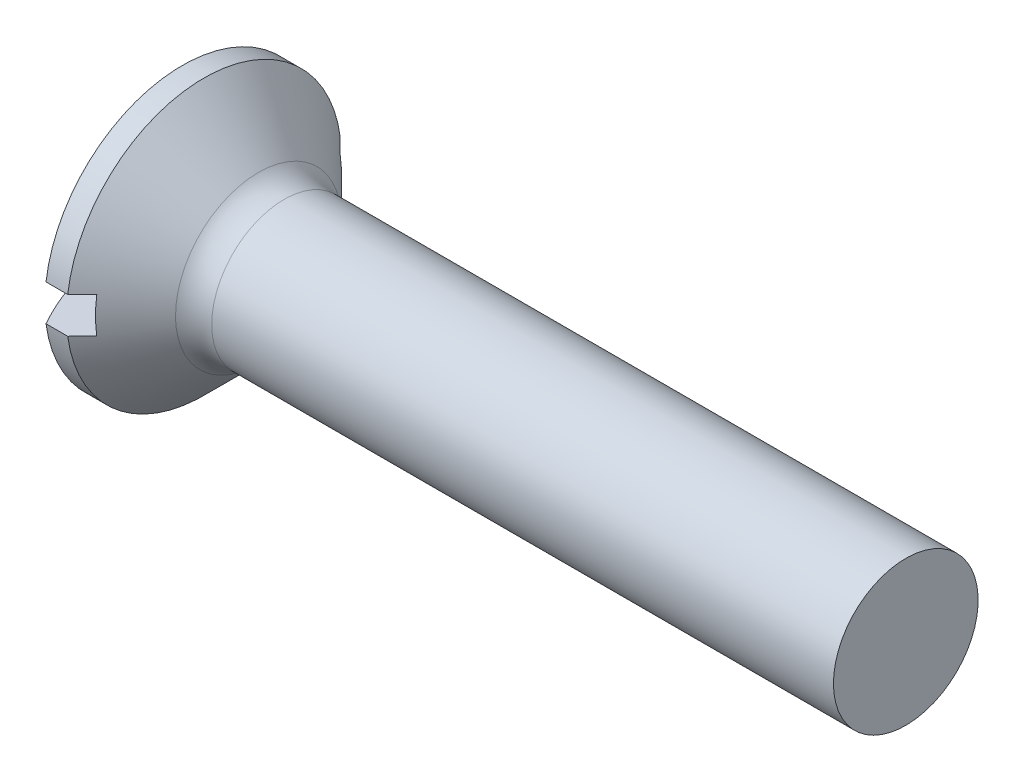
ISO-10303-21;
HEADER;
FILE_DESCRIPTION(('STEP AP214'),'2;1');
FILE_NAME('part.step','',(''),(''),'','','');
FILE_SCHEMA(('AUTOMOTIVE_DESIGN { 1 0 10303 214 1 1 1 1 }'));
ENDSEC;
DATA;
#1=APPLICATION_CONTEXT('core data for automotive mechanical design processes');
#2=APPLICATION_PROTOCOL_DEFINITION('international standard','automotive_design',2000,#1);
#3=PRODUCT_CONTEXT('',#1,'mechanical');
#4=PRODUCT('Part','Part','',(#3));
#5=PRODUCT_RELATED_PRODUCT_CATEGORY('part','',(#4));
#6=PRODUCT_DEFINITION_FORMATION('','',#4);
#7=PRODUCT_DEFINITION_CONTEXT('part definition',#1,'design');
#8=PRODUCT_DEFINITION('design','',#6,#7);
#9=PRODUCT_DEFINITION_SHAPE('','',#8);
#10=(LENGTH_UNIT() NAMED_UNIT(*) SI_UNIT(.MILLI.,.METRE.));
#11=(NAMED_UNIT(*) PLANE_ANGLE_UNIT() SI_UNIT($,.RADIAN.));
#12=(NAMED_UNIT(*) SI_UNIT($,.STERADIAN.) SOLID_ANGLE_UNIT());
#13=UNCERTAINTY_MEASURE_WITH_UNIT(LENGTH_MEASURE(1.E-05),#10,'distance_accuracy_value','');
#14=(GEOMETRIC_REPRESENTATION_CONTEXT(3) GLOBAL_UNCERTAINTY_ASSIGNED_CONTEXT((#13)) GLOBAL_UNIT_ASSIGNED_CONTEXT((#10,
#11,#12)) REPRESENTATION_CONTEXT('',''));
#15=CARTESIAN_POINT('',(0.,0.,0.));
#16=DIRECTION('',(0.,0.,1.));
#17=DIRECTION('',(1.,0.,0.));
#18=AXIS2_PLACEMENT_3D('',#15,#16,#17);
#19=CARTESIAN_POINT('',(3.86,0.,0.));
#20=DIRECTION('',(-1.,0.,0.));
#21=DIRECTION('',(0.,-1.,0.));
#22=AXIS2_PLACEMENT_3D('',#19,#20,#21);
#23=SPHERICAL_SURFACE('',#22,3.86);
#24=CARTESIAN_POINT('',(3.86,0.25,0.));
#25=DIRECTION('',(0.,1.,0.));
#26=DIRECTION('',(0.,0.,1.));
#27=AXIS2_PLACEMENT_3D('',#24,#25,#26);
#28=CIRCLE('',#27,3.85189563721553);
#29=CARTESIAN_POINT('',(0.5,0.25,1.88348082018374));
#30=VERTEX_POINT('',#29);
#31=CARTESIAN_POINT('',(0.5,0.25,-1.88348082018374));
#32=VERTEX_POINT('',#31);
#33=EDGE_CURVE('E184',#30,#32,#28,.F.);
#34=ORIENTED_EDGE('',*,*,#33,.F.);
#35=CARTESIAN_POINT('',(0.5,0.,0.));
#36=DIRECTION('',(-1.,0.,0.));
#37=DIRECTION('',(0.,0.,1.));
#38=AXIS2_PLACEMENT_3D('',#35,#36,#37);
#39=CIRCLE('',#38,1.9);
#40=EDGE_CURVE('E118',#30,#32,#39,.T.);
#41=ORIENTED_EDGE('',*,*,#40,.T.);
#42=EDGE_LOOP('',(#34,#41));
#43=FACE_BOUND('',#42,.T.);
#44=ADVANCED_FACE('F38',(#43),#23,.T.);
#45=CARTESIAN_POINT('',(-15.875,0.,0.));
#46=DIRECTION('',(-1.,0.,0.));
#47=DIRECTION('',(0.,0.,1.));
#48=AXIS2_PLACEMENT_3D('',#45,#46,#47);
#49=CYLINDRICAL_SURFACE('',#48,1.9);
#50=CARTESIAN_POINT('',(0.800000000000002,0.,0.));
#51=DIRECTION('',(-1.,0.,0.));
#52=DIRECTION('',(0.,0.,1.));
#53=AXIS2_PLACEMENT_3D('',#50,#51,#52);
#54=CIRCLE('',#53,1.9);
#55=CARTESIAN_POINT('',(0.800000000000002,0.25,1.88348082018374));
#56=VERTEX_POINT('',#55);
#57=CARTESIAN_POINT('',(0.799999999999999,0.25,-1.88348082018374));
#58=VERTEX_POINT('',#57);
#59=EDGE_CURVE('E112',#56,#58,#54,.T.);
#60=ORIENTED_EDGE('',*,*,#59,.T.);
#61=DIRECTION('',(-1.,0.,0.));
#62=VECTOR('',#61,1.);
#63=CARTESIAN_POINT('',(-15.875,0.25,-1.88348082018374));
#64=LINE('',#63,#62);
#65=EDGE_CURVE('E66',#58,#32,#64,.T.);
#66=ORIENTED_EDGE('',*,*,#65,.T.);
#67=ORIENTED_EDGE('',*,*,#40,.F.);
#68=DIRECTION('',(-1.,0.,0.));
#69=VECTOR('',#68,1.);
#70=CARTESIAN_POINT('',(-15.875,0.25,1.88348082018374));
#71=LINE('',#70,#69);
#72=EDGE_CURVE('E182',#30,#56,#71,.F.);
#73=ORIENTED_EDGE('',*,*,#72,.T.);
#74=EDGE_LOOP('',(#60,#66,#67,#73));
#75=FACE_BOUND('',#74,.T.);
#76=ADVANCED_FACE('F156',(#75),#49,.T.);
#77=CARTESIAN_POINT('',(10.5,0.,0.));
#78=DIRECTION('',(-1.,0.,0.));
#79=DIRECTION('',(0.,0.,1.));
#80=AXIS2_PLACEMENT_3D('',#77,#78,#79);
#81=PLANE('',#80);
#82=CARTESIAN_POINT('',(10.5,0.,0.));
#83=DIRECTION('',(-1.,0.,0.));
#84=DIRECTION('',(0.,0.,1.));
#85=AXIS2_PLACEMENT_3D('',#82,#83,#84);
#86=CIRCLE('',#85,1.);
#87=CARTESIAN_POINT('',(10.5,0.,1.));
#88=VERTEX_POINT('',#87);
#89=EDGE_CURVE('E121',#88,#88,#86,.T.);
#90=ORIENTED_EDGE('',*,*,#89,.F.);
#91=EDGE_LOOP('',(#90));
#92=FACE_BOUND('',#91,.T.);
#93=ADVANCED_FACE('F163',(#92),#81,.F.);
#94=CARTESIAN_POINT('',(3.86,-0.25,0.));
#95=DIRECTION('',(0.,-1.,0.));
#96=DIRECTION('',(0.,0.,-1.));
#97=AXIS2_PLACEMENT_3D('',#94,#95,#96);
#98=CIRCLE('',#97,3.85189563721553);
#99=CARTESIAN_POINT('',(0.5,-0.25,-1.88348082018374));
#100=VERTEX_POINT('',#99);
#101=CARTESIAN_POINT('',(0.5,-0.25,1.88348082018374));
#102=VERTEX_POINT('',#101);
#103=EDGE_CURVE('E174',#100,#102,#98,.F.);
#104=ORIENTED_EDGE('',*,*,#103,.F.);
#105=EDGE_CURVE('E114',#100,#102,#39,.T.);
#106=ORIENTED_EDGE('',*,*,#105,.T.);
#107=EDGE_LOOP('',(#104,#106));
#108=FACE_BOUND('',#107,.T.);
#109=ADVANCED_FACE('F159',(#108),#23,.T.);
#110=CARTESIAN_POINT('',(0.800000000000002,-0.25,-1.88348082018374));
#111=VERTEX_POINT('',#110);
#112=CARTESIAN_POINT('',(0.799999999999999,-0.25,1.88348082018374));
#113=VERTEX_POINT('',#112);
#114=EDGE_CURVE('E115',#111,#113,#54,.T.);
#115=ORIENTED_EDGE('',*,*,#114,.T.);
#116=DIRECTION('',(-1.,0.,0.));
#117=VECTOR('',#116,1.);
#118=CARTESIAN_POINT('',(-15.875,-0.25,1.88348082018374));
#119=LINE('',#118,#117);
#120=EDGE_CURVE('E177',#113,#102,#119,.T.);
#121=ORIENTED_EDGE('',*,*,#120,.T.);
#122=ORIENTED_EDGE('',*,*,#105,.F.);
#123=DIRECTION('',(-1.,0.,0.));
#124=VECTOR('',#123,1.);
#125=CARTESIAN_POINT('',(-15.875,-0.25,-1.88348082018374));
#126=LINE('',#125,#124);
#127=EDGE_CURVE('E178',#100,#111,#126,.F.);
#128=ORIENTED_EDGE('',*,*,#127,.T.);
#129=EDGE_LOOP('',(#115,#121,#122,#128));
#130=FACE_BOUND('',#129,.T.);
#131=ADVANCED_FACE('F153',(#130),#49,.T.);
#132=CARTESIAN_POINT('',(0.800000000000002,0.,0.));
#133=DIRECTION('',(-1.,0.,0.));
#134=DIRECTION('',(0.,0.,1.));
#135=AXIS2_PLACEMENT_3D('',#132,#133,#134);
#136=CONICAL_SURFACE('',#135,1.9,0.78539816339745);
#137=CARTESIAN_POINT('',(-1.48335571085285,0.25,-4.17587894981706));
#138=CARTESIAN_POINT('',(-1.34091780953969,0.25,-4.03318397626447));
#139=CARTESIAN_POINT('',(-1.19849104940031,0.25,-3.89047787278503));
#140=CARTESIAN_POINT('',(-0.913672159167951,0.25,-3.60502718507285));
#141=CARTESIAN_POINT('',(-0.771280029579722,0.25,-3.46228260033647));
#142=CARTESIAN_POINT('',(-0.486502370451668,0.25,-3.17669823151576));
#143=CARTESIAN_POINT('',(-0.34411685675805,0.25,-3.0338584316294));
#144=CARTESIAN_POINT('',(-0.0594245111696583,0.25,-2.74810424632909));
#145=CARTESIAN_POINT('',(0.0828823217575492,0.25,-2.60518986194407));
#146=CARTESIAN_POINT('',(0.370982771498694,0.25,-2.31560790035791));
#147=CARTESIAN_POINT('',(0.516773194195064,0.25,-2.16893714574575));
#148=CARTESIAN_POINT('',(0.808133914683256,0.25,-1.87536527545102));
#149=CARTESIAN_POINT('',(0.953704203505956,0.25,-1.72846415085392));
#150=CARTESIAN_POINT('',(1.17168494413728,0.25,-1.5077711542338));
#151=CARTESIAN_POINT('',(1.2442755563804,0.25,-1.43415726001499));
#152=CARTESIAN_POINT('',(1.38926735887179,0.25,-1.28674053334544));
#153=CARTESIAN_POINT('',(1.46166854610802,0.25,-1.21293769792682));
#154=CARTESIAN_POINT('',(1.60614296995785,0.25,-1.0650226012937));
#155=CARTESIAN_POINT('',(1.67821623039845,0.25,-0.990910363335527));
#156=CARTESIAN_POINT('',(1.82177982069808,0.25,-0.842124008018405));
#157=CARTESIAN_POINT('',(1.89327017057343,0.25,-0.767449910123667));
#158=CARTESIAN_POINT('',(1.98320515028655,0.25,-0.671818194829616));
#159=CARTESIAN_POINT('',(2.00227123131989,0.25,-0.651446455913231));
#160=CARTESIAN_POINT('',(2.04026729045664,0.25,-0.61057639065864));
#161=CARTESIAN_POINT('',(2.0591972665803,0.25,-0.590078062487135));
#162=CARTESIAN_POINT('',(2.11564955364518,0.25,-0.528437277270501));
#163=CARTESIAN_POINT('',(2.15291907475524,0.25,-0.487059400109448));
#164=CARTESIAN_POINT('',(2.21265954768099,0.25,-0.418528420401159));
#165=CARTESIAN_POINT('',(2.23553874303145,0.25,-0.391731875001628));
#166=CARTESIAN_POINT('',(2.28046924052337,0.25,-0.337268767044614));
#167=CARTESIAN_POINT('',(2.30251713324563,0.25,-0.309599330086643));
#168=CARTESIAN_POINT('',(2.33437076352798,0.25,-0.266969499468902));
#169=CARTESIAN_POINT('',(2.34483147774891,0.25,-0.252501823680049));
#170=CARTESIAN_POINT('',(2.3650896771876,0.25,-0.223112318453096));
#171=CARTESIAN_POINT('',(2.37488741271737,0.25,-0.208190663537372));
#172=CARTESIAN_POINT('',(2.39346227926775,0.25,-0.177791346994125));
#173=CARTESIAN_POINT('',(2.40224312184802,0.25,-0.162315995805791));
#174=CARTESIAN_POINT('',(2.41827225578154,0.25,-0.130604520305753));
#175=CARTESIAN_POINT('',(2.42552338665508,0.25,-0.114369875133108));
#176=CARTESIAN_POINT('',(2.4377463895775,0.25,-0.0807694061606717));
#177=CARTESIAN_POINT('',(2.4426867350613,0.25,-0.0633914293134236));
#178=CARTESIAN_POINT('',(2.44901736900656,0.25,-0.0280678007029174));
#179=CARTESIAN_POINT('',(2.45043133307122,0.25,-0.0101267582125421));
#180=CARTESIAN_POINT('',(2.44932721168069,0.25,0.0256677176592282));
#181=CARTESIAN_POINT('',(2.44679929368283,0.25,0.0435208201752036));
#182=CARTESIAN_POINT('',(2.43851921802988,0.25,0.0785328676630111));
#183=CARTESIAN_POINT('',(2.43274442294382,0.25,0.0956860219307946));
#184=CARTESIAN_POINT('',(2.41763500050122,0.25,0.132554039746546));
#185=CARTESIAN_POINT('',(2.40780938478112,0.25,0.152058103000793));
#186=CARTESIAN_POINT('',(2.38634722718369,0.25,0.190062061993057));
#187=CARTESIAN_POINT('',(2.3747061879441,0.25,0.208559305733039));
#188=CARTESIAN_POINT('',(2.3502618181105,0.25,0.244947247692008));
#189=CARTESIAN_POINT('',(2.3374508798656,0.25,0.262832757281324));
#190=CARTESIAN_POINT('',(2.31115223185066,0.25,0.29805697430077));
#191=CARTESIAN_POINT('',(2.29766540992245,0.25,0.315396352746965));
#192=CARTESIAN_POINT('',(2.25226424709363,0.25,0.372219194378195));
#193=CARTESIAN_POINT('',(2.21937919655121,0.25,0.410921418479802));
#194=CARTESIAN_POINT('',(2.1525335582698,0.25,0.487389981237357));
#195=CARTESIAN_POINT('',(2.11857252658025,0.25,0.525155921818419));
#196=CARTESIAN_POINT('',(2.05000356784358,0.25,0.600190619605776));
#197=CARTESIAN_POINT('',(2.01539482678331,0.25,0.637458633980358));
#198=CARTESIAN_POINT('',(1.94582440500373,0.25,0.711648515398939));
#199=CARTESIAN_POINT('',(1.91086279219921,0.25,0.748570446508972));
#200=CARTESIAN_POINT('',(1.80607213665663,0.25,0.858550927175536));
#201=CARTESIAN_POINT('',(1.73590607289066,0.25,0.931288088222743));
#202=CARTESIAN_POINT('',(1.59518965311118,0.25,1.07628878824625));
#203=CARTESIAN_POINT('',(1.52463960019806,0.25,1.14855262289673));
#204=CARTESIAN_POINT('',(1.33310092326795,0.25,1.34407689573881));
#205=CARTESIAN_POINT('',(1.21187584578054,0.25,1.46710567153049));
#206=CARTESIAN_POINT('',(0.969103453069111,0.25,1.71284625802524));
#207=CARTESIAN_POINT('',(0.847556134825288,0.25,1.83555806573648));
#208=CARTESIAN_POINT('',(0.482574915643865,0.25,2.20351484490134));
#209=CARTESIAN_POINT('',(0.23888045842235,0.25,2.44850137195123));
#210=CARTESIAN_POINT('',(-0.251201372323892,0.25,2.94067453004826));
#211=CARTESIAN_POINT('',(-0.497591280630995,0.25,3.18785863262539));
#212=CARTESIAN_POINT('',(-0.990433114627758,0.25,3.68199435926828));
#213=CARTESIAN_POINT('',(-1.23688498931923,0.25,3.92894603419116));
#214=CARTESIAN_POINT('',(-1.48335571085285,0.25,4.17587894981706));
#215=B_SPLINE_CURVE_WITH_KNOTS('',3,(#137,#138,#139,#140,#141,#142,#143,#144,#145,#146,#147,
#148,#149,#150,#151,#152,#153,#154,#155,#156,#157,#158,#159,#160,#161,#162,#163,#164,#165,#166,
#167,#168,#169,#170,#171,#172,#173,#174,#175,#176,#177,#178,#179,#180,#181,#182,#183,#184,#185,
#186,#187,#188,#189,#190,#191,#192,#193,#194,#195,#196,#197,#198,#199,#200,#201,#202,#203,#204,
#205,#206,#207,#208,#209,#210,#211,#212,#213,#214),.UNSPECIFIED.,.F.,.F.,(4,2,2,2,2,2,2,2,2,2,2,
2,2,2,2,2,2,2,2,2,2,2,2,2,2,2,2,2,2,2,2,2,2,2,2,2,2,2,4),(0.,0.604858423348015,1.20972518968767,
1.8147802048125,2.41982708257305,3.04023369942367,3.66066494744744,3.97081901339496,
4.28097798149448,4.59111404170803,4.90123940706011,4.984944760409,5.06865132885717,
5.23569422665408,5.34139201199537,5.44748437411758,5.50103219956753,5.55455969355283,
5.60788521163412,5.66111085613478,5.71504288951888,5.7686118444823,5.82231463454785,
5.87639657135588,5.94174552153337,6.00725901101011,6.07323385117653,6.1391241891716,
6.2914266450305,6.4437927810217,6.59636532459231,6.74890904323716,7.05209651524557,
7.3550719354593,7.87322475423608,8.39138244604884,9.42803408388845,10.4750640749815,
11.5217315985015),.UNSPECIFIED.);
#216=CARTESIAN_POINT('',(1.,0.25,1.68151717208002));
#217=VERTEX_POINT('',#216);
#218=EDGE_CURVE('E11',#217,#56,#215,.T.);
#219=ORIENTED_EDGE('',*,*,#218,.F.);
#220=CARTESIAN_POINT('',(1.,0.,0.));
#221=DIRECTION('',(1.,0.,0.));
#222=DIRECTION('',(0.,0.,-1.));
#223=AXIS2_PLACEMENT_3D('',#220,#221,#222);
#224=CIRCLE('',#223,1.7);
#225=CARTESIAN_POINT('',(1.,-0.25,1.68151717208003));
#226=VERTEX_POINT('',#225);
#227=EDGE_CURVE('E95',#226,#217,#224,.F.);
#228=ORIENTED_EDGE('',*,*,#227,.F.);
#229=CARTESIAN_POINT('',(-1.48335571085285,-0.25,4.17587894981706));
#230=CARTESIAN_POINT('',(-1.34091780953969,-0.25,4.03318397626447));
#231=CARTESIAN_POINT('',(-1.19849104940031,-0.25,3.89047787278503));
#232=CARTESIAN_POINT('',(-0.913672159167952,-0.25,3.60502718507285));
#233=CARTESIAN_POINT('',(-0.771280029579723,-0.25,3.46228260033647));
#234=CARTESIAN_POINT('',(-0.486502370451669,-0.25,3.17669823151576));
#235=CARTESIAN_POINT('',(-0.34411685675805,-0.25,3.0338584316294));
#236=CARTESIAN_POINT('',(-0.0594245111696589,-0.25,2.74810424632909));
#237=CARTESIAN_POINT('',(0.0828823217575483,-0.25,2.60518986194407));
#238=CARTESIAN_POINT('',(0.370982771498693,-0.25,2.31560790035791));
#239=CARTESIAN_POINT('',(0.516773194195063,-0.25,2.16893714574575));
#240=CARTESIAN_POINT('',(0.808133914683255,-0.25,1.87536527545102));
#241=CARTESIAN_POINT('',(0.953704203505955,-0.25,1.72846415085392));
#242=CARTESIAN_POINT('',(1.17168494413728,-0.25,1.5077711542338));
#243=CARTESIAN_POINT('',(1.2442755563804,-0.25,1.43415726001499));
#244=CARTESIAN_POINT('',(1.38926735887179,-0.25,1.28674053334545));
#245=CARTESIAN_POINT('',(1.46166854610802,-0.25,1.21293769792682));
#246=CARTESIAN_POINT('',(1.60614296995785,-0.25,1.0650226012937));
#247=CARTESIAN_POINT('',(1.67821623039845,-0.25,0.990910363335528));
#248=CARTESIAN_POINT('',(1.82177982069808,-0.25,0.842124008018405));
#249=CARTESIAN_POINT('',(1.89327017057343,-0.25,0.767449910123667));
#250=CARTESIAN_POINT('',(1.98320515028655,-0.25,0.671818194829616));
#251=CARTESIAN_POINT('',(2.00227123131989,-0.25,0.651446455913231));
#252=CARTESIAN_POINT('',(2.04026729045664,-0.25,0.61057639065864));
#253=CARTESIAN_POINT('',(2.0591972665803,-0.25,0.590078062487136));
#254=CARTESIAN_POINT('',(2.11564955364518,-0.25,0.528437277270502));
#255=CARTESIAN_POINT('',(2.15291907475524,-0.25,0.487059400109449));
#256=CARTESIAN_POINT('',(2.21265954768099,-0.25,0.418528420401159));
#257=CARTESIAN_POINT('',(2.23553874303145,-0.25,0.391731875001629));
#258=CARTESIAN_POINT('',(2.28046924052337,-0.25,0.337268767044614));
#259=CARTESIAN_POINT('',(2.30251713324563,-0.25,0.309599330086644));
#260=CARTESIAN_POINT('',(2.33437076352798,-0.25,0.266969499468902));
#261=CARTESIAN_POINT('',(2.34483147774891,-0.25,0.252501823680049));
#262=CARTESIAN_POINT('',(2.3650896771876,-0.25,0.223112318453096));
#263=CARTESIAN_POINT('',(2.37488741271737,-0.25,0.208190663537373));
#264=CARTESIAN_POINT('',(2.39346227926775,-0.25,0.177791346994126));
#265=CARTESIAN_POINT('',(2.40224312184802,-0.25,0.162315995805791));
#266=CARTESIAN_POINT('',(2.41827225578154,-0.25,0.130604520305753));
#267=CARTESIAN_POINT('',(2.42552338665508,-0.25,0.114369875133108));
#268=CARTESIAN_POINT('',(2.4377463895775,-0.25,0.080769406160672));
#269=CARTESIAN_POINT('',(2.4426867350613,-0.25,0.0633914293134236));
#270=CARTESIAN_POINT('',(2.44901736900656,-0.25,0.0280678007029173));
#271=CARTESIAN_POINT('',(2.45043133307122,-0.25,0.0101267582125424));
#272=CARTESIAN_POINT('',(2.44932721168069,-0.25,-0.0256677176592273));
#273=CARTESIAN_POINT('',(2.44679929368283,-0.25,-0.0435208201752024));
#274=CARTESIAN_POINT('',(2.43851921802988,-0.25,-0.07853286766301));
#275=CARTESIAN_POINT('',(2.43274442294382,-0.25,-0.0956860219307939));
#276=CARTESIAN_POINT('',(2.41763500050122,-0.25,-0.132554039746545));
#277=CARTESIAN_POINT('',(2.40780938478112,-0.25,-0.152058103000792));
#278=CARTESIAN_POINT('',(2.38634722718369,-0.25,-0.190062061993056));
#279=CARTESIAN_POINT('',(2.3747061879441,-0.25,-0.208559305733038));
#280=CARTESIAN_POINT('',(2.3502618181105,-0.25,-0.244947247692008));
#281=CARTESIAN_POINT('',(2.3374508798656,-0.25,-0.262832757281324));
#282=CARTESIAN_POINT('',(2.31115223185066,-0.25,-0.298056974300769));
#283=CARTESIAN_POINT('',(2.29766540992245,-0.25,-0.315396352746964));
#284=CARTESIAN_POINT('',(2.25226424709363,-0.25,-0.372219194378193));
#285=CARTESIAN_POINT('',(2.21937919655121,-0.25,-0.4109214184798));
#286=CARTESIAN_POINT('',(2.15253355826981,-0.25,-0.487389981237355));
#287=CARTESIAN_POINT('',(2.11857252658025,-0.25,-0.525155921818416));
#288=CARTESIAN_POINT('',(2.05000356784358,-0.25,-0.600190619605773));
#289=CARTESIAN_POINT('',(2.01539482678331,-0.25,-0.637458633980356));
#290=CARTESIAN_POINT('',(1.94582440500374,-0.25,-0.711648515398937));
#291=CARTESIAN_POINT('',(1.91086279219921,-0.25,-0.748570446508969));
#292=CARTESIAN_POINT('',(1.80607213665663,-0.25,-0.858550927175533));
#293=CARTESIAN_POINT('',(1.73590607289066,-0.25,-0.931288088222739));
#294=CARTESIAN_POINT('',(1.59518965311118,-0.25,-1.07628878824624));
#295=CARTESIAN_POINT('',(1.52463960019807,-0.25,-1.14855262289672));
#296=CARTESIAN_POINT('',(1.33310092326795,-0.25,-1.3440768957388));
#297=CARTESIAN_POINT('',(1.21187584578054,-0.25,-1.46710567153048));
#298=CARTESIAN_POINT('',(0.969103453069117,-0.25,-1.71284625802523));
#299=CARTESIAN_POINT('',(0.847556134825294,-0.25,-1.83555806573648));
#300=CARTESIAN_POINT('',(0.482574915643871,-0.25,-2.20351484490134));
#301=CARTESIAN_POINT('',(0.238880458422356,-0.249999999999999,-2.44850137195123));
#302=CARTESIAN_POINT('',(-0.251201372323888,-0.249999999999999,-2.94067453004826));
#303=CARTESIAN_POINT('',(-0.497591280630992,-0.249999999999999,-3.18785863262538));
#304=CARTESIAN_POINT('',(-0.990433114627758,-0.249999999999999,-3.68199435926828));
#305=CARTESIAN_POINT('',(-1.23688498931923,-0.249999999999999,-3.92894603419116));
#306=CARTESIAN_POINT('',(-1.48335571085285,-0.249999999999999,-4.17587894981706));
#307=B_SPLINE_CURVE_WITH_KNOTS('',3,(#229,#230,#231,#232,#233,#234,#235,#236,#237,#238,#239,
#240,#241,#242,#243,#244,#245,#246,#247,#248,#249,#250,#251,#252,#253,#254,#255,#256,#257,#258,
#259,#260,#261,#262,#263,#264,#265,#266,#267,#268,#269,#270,#271,#272,#273,#274,#275,#276,#277,
#278,#279,#280,#281,#282,#283,#284,#285,#286,#287,#288,#289,#290,#291,#292,#293,#294,#295,#296,
#297,#298,#299,#300,#301,#302,#303,#304,#305,#306),.UNSPECIFIED.,.F.,.F.,(4,2,2,2,2,2,2,2,2,2,2,
2,2,2,2,2,2,2,2,2,2,2,2,2,2,2,2,2,2,2,2,2,2,2,2,2,2,2,4),(0.,0.604858423348016,1.20972518968767,
1.8147802048125,2.41982708257305,3.04023369942367,3.66066494744744,3.97081901339496,
4.28097798149448,4.59111404170803,4.90123940706011,4.984944760409,5.06865132885717,
5.23569422665408,5.34139201199537,5.44748437411758,5.50103219956753,5.55455969355283,
5.60788521163412,5.66111085613478,5.71504288951888,5.7686118444823,5.82231463454785,
5.87639657135588,5.94174552153337,6.00725901101011,6.07323385117653,6.1391241891716,
6.2914266450305,6.4437927810217,6.5963653245923,6.74890904323716,7.05209651524557,
7.35507193545929,7.87322475423607,8.39138244604883,9.42803408388844,10.4750640749815,
11.5217315985015),.UNSPECIFIED.);
#308=EDGE_CURVE('E52',#113,#226,#307,.T.);
#309=ORIENTED_EDGE('',*,*,#308,.F.);
#310=ORIENTED_EDGE('',*,*,#114,.F.);
#311=CARTESIAN_POINT('',(1.,-0.25,-1.68151717208003));
#312=VERTEX_POINT('',#311);
#313=EDGE_CURVE('E130',#312,#111,#307,.T.);
#314=ORIENTED_EDGE('',*,*,#313,.F.);
#315=CARTESIAN_POINT('',(1.,0.25,-1.68151717208002));
#316=VERTEX_POINT('',#315);
#317=EDGE_CURVE('E103',#316,#312,#224,.F.);
#318=ORIENTED_EDGE('',*,*,#317,.F.);
#319=EDGE_CURVE('E42',#58,#316,#215,.T.);
#320=ORIENTED_EDGE('',*,*,#319,.F.);
#321=ORIENTED_EDGE('',*,*,#59,.F.);
#322=EDGE_LOOP('',(#219,#228,#309,#310,#314,#318,#320,#321));
#323=FACE_BOUND('',#322,.T.);
#324=CARTESIAN_POINT('',(1.55355339059327,0.,0.));
#325=DIRECTION('',(1.,0.,0.));
#326=DIRECTION('',(0.,0.,-1.));
#327=AXIS2_PLACEMENT_3D('',#324,#325,#326);
#328=CIRCLE('',#327,1.14644660940673);
#329=CARTESIAN_POINT('',(1.55355339059327,0.,-1.14644660940673));
#330=VERTEX_POINT('',#329);
#331=EDGE_CURVE('E125',#330,#330,#328,.F.);
#332=ORIENTED_EDGE('',*,*,#331,.T.);
#333=EDGE_LOOP('',(#332));
#334=FACE_BOUND('',#333,.T.);
#335=ADVANCED_FACE('F109',(#323,#334),#136,.T.);
#336=CARTESIAN_POINT('',(-15.875,0.,0.));
#337=DIRECTION('',(-1.,0.,0.));
#338=DIRECTION('',(0.,0.,1.));
#339=AXIS2_PLACEMENT_3D('',#336,#337,#338);
#340=CYLINDRICAL_SURFACE('',#339,1.);
#341=CARTESIAN_POINT('',(1.90710678118655,0.,0.));
#342=DIRECTION('',(-1.,0.,0.));
#343=DIRECTION('',(0.,0.,1.));
#344=AXIS2_PLACEMENT_3D('',#341,#342,#343);
#345=CIRCLE('',#344,1.);
#346=CARTESIAN_POINT('',(1.90710678118655,0.,1.));
#347=VERTEX_POINT('',#346);
#348=EDGE_CURVE('E128',#347,#347,#345,.F.);
#349=ORIENTED_EDGE('',*,*,#348,.T.);
#350=EDGE_LOOP('',(#349));
#351=FACE_BOUND('',#350,.T.);
#352=ORIENTED_EDGE('',*,*,#89,.T.);
#353=EDGE_LOOP('',(#352));
#354=FACE_BOUND('',#353,.T.);
#355=ADVANCED_FACE('F145',(#351,#354),#340,.T.);
#356=CARTESIAN_POINT('',(1.90710678118655,0.,0.));
#357=DIRECTION('',(-1.,0.,0.));
#358=DIRECTION('',(0.,0.,1.));
#359=AXIS2_PLACEMENT_3D('',#356,#357,#358);
#360=TOROIDAL_SURFACE('',#359,1.5,0.5);
#361=ORIENTED_EDGE('',*,*,#348,.F.);
#362=EDGE_LOOP('',(#361));
#363=FACE_BOUND('',#362,.T.);
#364=ORIENTED_EDGE('',*,*,#331,.F.);
#365=EDGE_LOOP('',(#364));
#366=FACE_BOUND('',#365,.T.);
#367=ADVANCED_FACE('F40',(#363,#366),#360,.F.);
#368=CARTESIAN_POINT('',(1.,0.25,1.9));
#369=DIRECTION('',(0.,1.,0.));
#370=DIRECTION('',(0.,0.,1.));
#371=AXIS2_PLACEMENT_3D('',#368,#369,#370);
#372=PLANE('',#371);
#373=ORIENTED_EDGE('',*,*,#319,.T.);
#374=DIRECTION('',(0.,0.,-1.));
#375=VECTOR('',#374,1.);
#376=CARTESIAN_POINT('',(1.,0.25,1.9));
#377=LINE('',#376,#375);
#378=EDGE_CURVE('E59',#217,#316,#377,.T.);
#379=ORIENTED_EDGE('',*,*,#378,.F.);
#380=ORIENTED_EDGE('',*,*,#218,.T.);
#381=ORIENTED_EDGE('',*,*,#72,.F.);
#382=ORIENTED_EDGE('',*,*,#33,.T.);
#383=ORIENTED_EDGE('',*,*,#65,.F.);
#384=EDGE_LOOP('',(#373,#379,#380,#381,#382,#383));
#385=FACE_BOUND('',#384,.T.);
#386=ADVANCED_FACE('F104',(#385),#372,.F.);
#387=CARTESIAN_POINT('',(1.,-0.25,-1.9));
#388=DIRECTION('',(0.,-1.,0.));
#389=DIRECTION('',(0.,0.,-1.));
#390=AXIS2_PLACEMENT_3D('',#387,#388,#389);
#391=PLANE('',#390);
#392=ORIENTED_EDGE('',*,*,#308,.T.);
#393=DIRECTION('',(0.,0.,1.));
#394=VECTOR('',#393,1.);
#395=CARTESIAN_POINT('',(1.,-0.25,-1.9));
#396=LINE('',#395,#394);
#397=EDGE_CURVE('E98',#312,#226,#396,.T.);
#398=ORIENTED_EDGE('',*,*,#397,.F.);
#399=ORIENTED_EDGE('',*,*,#313,.T.);
#400=ORIENTED_EDGE('',*,*,#127,.F.);
#401=ORIENTED_EDGE('',*,*,#103,.T.);
#402=ORIENTED_EDGE('',*,*,#120,.F.);
#403=EDGE_LOOP('',(#392,#398,#399,#400,#401,#402));
#404=FACE_BOUND('',#403,.T.);
#405=ADVANCED_FACE('F138',(#404),#391,.F.);
#406=CARTESIAN_POINT('',(1.,-0.25,-1.9));
#407=DIRECTION('',(1.,0.,0.));
#408=DIRECTION('',(0.,0.,-1.));
#409=AXIS2_PLACEMENT_3D('',#406,#407,#408);
#410=PLANE('',#409);
#411=ORIENTED_EDGE('',*,*,#227,.T.);
#412=ORIENTED_EDGE('',*,*,#378,.T.);
#413=ORIENTED_EDGE('',*,*,#317,.T.);
#414=ORIENTED_EDGE('',*,*,#397,.T.);
#415=EDGE_LOOP('',(#411,#412,#413,#414));
#416=FACE_BOUND('',#415,.T.);
#417=ADVANCED_FACE('F96',(#416),#410,.F.);
#418=CLOSED_SHELL('',(#44,#76,#93,#109,#131,#335,#355,#367,#386,#405,#417));
#419=MANIFOLD_SOLID_BREP('B2',#418);
#420=ADVANCED_BREP_SHAPE_REPRESENTATION('',(#18,#419),#14);
#421=SHAPE_DEFINITION_REPRESENTATION(#9,#420);
ENDSEC;
END-ISO-10303-21;
